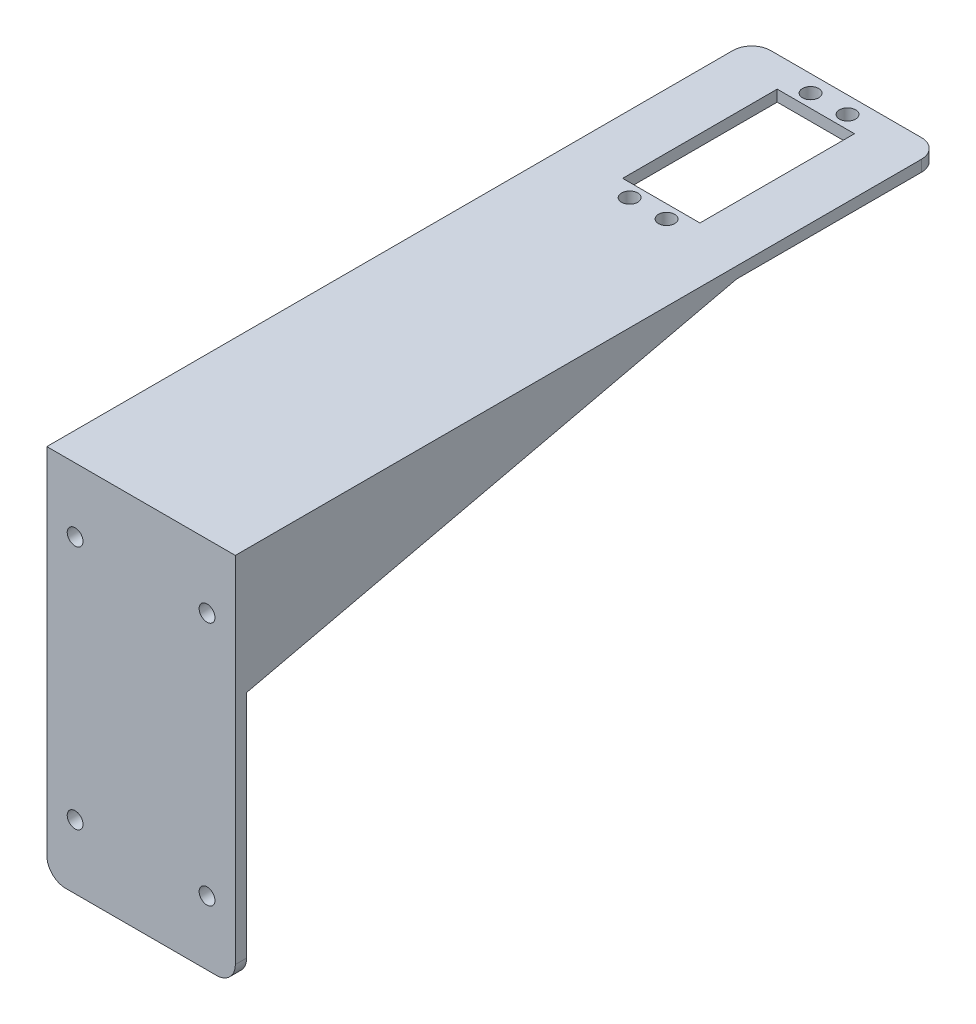
ISO-10303-21;
HEADER;
FILE_DESCRIPTION(('STEP AP214'),'2;1');
FILE_NAME('part.step','',(''),(''),'','','');
FILE_SCHEMA(('AUTOMOTIVE_DESIGN { 1 0 10303 214 1 1 1 1 }'));
ENDSEC;
DATA;
#1=APPLICATION_CONTEXT('core data for automotive mechanical design processes');
#2=APPLICATION_PROTOCOL_DEFINITION('international standard','automotive_design',2000,#1);
#3=PRODUCT_CONTEXT('',#1,'mechanical');
#4=PRODUCT('Part','Part','',(#3));
#5=PRODUCT_RELATED_PRODUCT_CATEGORY('part','',(#4));
#6=PRODUCT_DEFINITION_FORMATION('','',#4);
#7=PRODUCT_DEFINITION_CONTEXT('part definition',#1,'design');
#8=PRODUCT_DEFINITION('design','',#6,#7);
#9=PRODUCT_DEFINITION_SHAPE('','',#8);
#10=(LENGTH_UNIT() NAMED_UNIT(*) SI_UNIT(.MILLI.,.METRE.));
#11=(NAMED_UNIT(*) PLANE_ANGLE_UNIT() SI_UNIT($,.RADIAN.));
#12=(NAMED_UNIT(*) SI_UNIT($,.STERADIAN.) SOLID_ANGLE_UNIT());
#13=UNCERTAINTY_MEASURE_WITH_UNIT(LENGTH_MEASURE(1.E-05),#10,'distance_accuracy_value','');
#14=(GEOMETRIC_REPRESENTATION_CONTEXT(3) GLOBAL_UNCERTAINTY_ASSIGNED_CONTEXT((#13)) GLOBAL_UNIT_ASSIGNED_CONTEXT((#10,
#11,#12)) REPRESENTATION_CONTEXT('',''));
#15=CARTESIAN_POINT('',(0.,0.,0.));
#16=DIRECTION('',(0.,0.,1.));
#17=DIRECTION('',(1.,0.,0.));
#18=AXIS2_PLACEMENT_3D('',#15,#16,#17);
#19=CARTESIAN_POINT('',(0.,0.,0.));
#20=DIRECTION('',(0.,1.,0.));
#21=DIRECTION('',(0.,0.,1.));
#22=AXIS2_PLACEMENT_3D('',#19,#20,#21);
#23=PLANE('',#22);
#24=DIRECTION('',(-1.,0.,0.));
#25=VECTOR('',#24,1.);
#26=CARTESIAN_POINT('',(-10.25,0.,-44.5));
#27=LINE('',#26,#25);
#28=CARTESIAN_POINT('',(10.25,0.,-44.5));
#29=VERTEX_POINT('',#28);
#30=CARTESIAN_POINT('',(-10.25,0.,-44.5));
#31=VERTEX_POINT('',#30);
#32=EDGE_CURVE('E287',#29,#31,#27,.T.);
#33=ORIENTED_EDGE('',*,*,#32,.F.);
#34=DIRECTION('',(0.,0.,1.));
#35=VECTOR('',#34,1.);
#36=CARTESIAN_POINT('',(10.25,0.,-44.5));
#37=LINE('',#36,#35);
#38=CARTESIAN_POINT('',(10.25,0.,-85.5));
#39=VERTEX_POINT('',#38);
#40=EDGE_CURVE('E239',#39,#29,#37,.T.);
#41=ORIENTED_EDGE('',*,*,#40,.F.);
#42=DIRECTION('',(1.,0.,0.));
#43=VECTOR('',#42,1.);
#44=CARTESIAN_POINT('',(-10.25,0.,-85.5));
#45=LINE('',#44,#43);
#46=CARTESIAN_POINT('',(-10.25,0.,-85.5));
#47=VERTEX_POINT('',#46);
#48=EDGE_CURVE('E272',#47,#39,#45,.T.);
#49=ORIENTED_EDGE('',*,*,#48,.F.);
#50=DIRECTION('',(0.,0.,-1.));
#51=VECTOR('',#50,1.);
#52=CARTESIAN_POINT('',(-10.25,0.,-44.5));
#53=LINE('',#52,#51);
#54=EDGE_CURVE('E291',#31,#47,#53,.T.);
#55=ORIENTED_EDGE('',*,*,#54,.F.);
#56=EDGE_LOOP('',(#33,#41,#49,#55));
#57=FACE_BOUND('',#56,.T.);
#58=CARTESIAN_POINT('',(-4.89999999999996,0.,-89.));
#59=DIRECTION('',(0.,-1.,0.));
#60=DIRECTION('',(0.,0.,-1.));
#61=AXIS2_PLACEMENT_3D('',#58,#59,#60);
#62=CIRCLE('',#61,2.15);
#63=CARTESIAN_POINT('',(-4.89999999999996,0.,-91.15));
#64=VERTEX_POINT('',#63);
#65=EDGE_CURVE('E240',#64,#64,#62,.T.);
#66=ORIENTED_EDGE('',*,*,#65,.F.);
#67=EDGE_LOOP('',(#66));
#68=FACE_BOUND('',#67,.T.);
#69=CARTESIAN_POINT('',(4.90000000000004,0.,-89.));
#70=DIRECTION('',(0.,-1.,0.));
#71=DIRECTION('',(0.,0.,1.));
#72=AXIS2_PLACEMENT_3D('',#69,#70,#71);
#73=CIRCLE('',#72,2.15);
#74=CARTESIAN_POINT('',(4.90000000000004,0.,-86.85));
#75=VERTEX_POINT('',#74);
#76=EDGE_CURVE('E248',#75,#75,#73,.T.);
#77=ORIENTED_EDGE('',*,*,#76,.F.);
#78=EDGE_LOOP('',(#77));
#79=FACE_BOUND('',#78,.T.);
#80=CARTESIAN_POINT('',(4.89999999999996,0.,-41.));
#81=DIRECTION('',(0.,-1.,0.));
#82=DIRECTION('',(0.,0.,-1.));
#83=AXIS2_PLACEMENT_3D('',#80,#81,#82);
#84=CIRCLE('',#83,2.15);
#85=CARTESIAN_POINT('',(4.89999999999996,0.,-43.15));
#86=VERTEX_POINT('',#85);
#87=EDGE_CURVE('E256',#86,#86,#84,.T.);
#88=ORIENTED_EDGE('',*,*,#87,.F.);
#89=EDGE_LOOP('',(#88));
#90=FACE_BOUND('',#89,.T.);
#91=CARTESIAN_POINT('',(-4.90000000000004,0.,-41.));
#92=DIRECTION('',(0.,-1.,0.));
#93=DIRECTION('',(0.,0.,1.));
#94=AXIS2_PLACEMENT_3D('',#91,#92,#93);
#95=CIRCLE('',#94,2.15);
#96=CARTESIAN_POINT('',(-4.90000000000004,0.,-38.85));
#97=VERTEX_POINT('',#96);
#98=EDGE_CURVE('E234',#97,#97,#95,.T.);
#99=ORIENTED_EDGE('',*,*,#98,.F.);
#100=EDGE_LOOP('',(#99));
#101=FACE_BOUND('',#100,.T.);
#102=DIRECTION('',(0.,0.,-1.));
#103=VECTOR('',#102,1.);
#104=CARTESIAN_POINT('',(-23.,0.,90.5));
#105=LINE('',#104,#103);
#106=CARTESIAN_POINT('',(-23.,0.,90.5));
#107=VERTEX_POINT('',#106);
#108=CARTESIAN_POINT('',(-23.,0.,-39.5));
#109=VERTEX_POINT('',#108);
#110=EDGE_CURVE('E55',#107,#109,#105,.T.);
#111=ORIENTED_EDGE('',*,*,#110,.T.);
#112=DIRECTION('',(-1.,0.,0.));
#113=VECTOR('',#112,1.);
#114=CARTESIAN_POINT('',(-23.,0.,-39.5));
#115=LINE('',#114,#113);
#116=CARTESIAN_POINT('',(-25.,0.,-39.5));
#117=VERTEX_POINT('',#116);
#118=EDGE_CURVE('E59',#109,#117,#115,.T.);
#119=ORIENTED_EDGE('',*,*,#118,.T.);
#120=DIRECTION('',(0.,0.,1.));
#121=VECTOR('',#120,1.);
#122=CARTESIAN_POINT('',(-25.,0.,-93.5));
#123=LINE('',#122,#121);
#124=CARTESIAN_POINT('',(-25.,0.,-88.5));
#125=VERTEX_POINT('',#124);
#126=EDGE_CURVE('E316',#125,#117,#123,.T.);
#127=ORIENTED_EDGE('',*,*,#126,.F.);
#128=CARTESIAN_POINT('',(-20.,0.,-88.5));
#129=DIRECTION('',(0.,1.,0.));
#130=DIRECTION('',(0.,0.,1.));
#131=AXIS2_PLACEMENT_3D('',#128,#129,#130);
#132=CIRCLE('',#131,5.);
#133=CARTESIAN_POINT('',(-20.,0.,-93.5));
#134=VERTEX_POINT('',#133);
#135=EDGE_CURVE('E396',#125,#134,#132,.F.);
#136=ORIENTED_EDGE('',*,*,#135,.T.);
#137=DIRECTION('',(-1.,0.,0.));
#138=VECTOR('',#137,1.);
#139=CARTESIAN_POINT('',(-25.,0.,-93.5));
#140=LINE('',#139,#138);
#141=CARTESIAN_POINT('',(20.,0.,-93.5));
#142=VERTEX_POINT('',#141);
#143=EDGE_CURVE('E329',#142,#134,#140,.T.);
#144=ORIENTED_EDGE('',*,*,#143,.F.);
#145=CARTESIAN_POINT('',(20.,0.,-88.5));
#146=DIRECTION('',(0.,1.,0.));
#147=DIRECTION('',(0.,0.,1.));
#148=AXIS2_PLACEMENT_3D('',#145,#146,#147);
#149=CIRCLE('',#148,5.);
#150=CARTESIAN_POINT('',(25.,0.,-88.5));
#151=VERTEX_POINT('',#150);
#152=EDGE_CURVE('E399',#142,#151,#149,.F.);
#153=ORIENTED_EDGE('',*,*,#152,.T.);
#154=DIRECTION('',(0.,0.,-1.));
#155=VECTOR('',#154,1.);
#156=CARTESIAN_POINT('',(25.,0.,-93.5));
#157=LINE('',#156,#155);
#158=CARTESIAN_POINT('',(25.,0.,-39.5));
#159=VERTEX_POINT('',#158);
#160=EDGE_CURVE('E301',#159,#151,#157,.T.);
#161=ORIENTED_EDGE('',*,*,#160,.F.);
#162=DIRECTION('',(1.,0.,0.));
#163=VECTOR('',#162,1.);
#164=CARTESIAN_POINT('',(23.,0.,-39.5));
#165=LINE('',#164,#163);
#166=CARTESIAN_POINT('',(23.,0.,-39.5));
#167=VERTEX_POINT('',#166);
#168=EDGE_CURVE('E185',#167,#159,#165,.T.);
#169=ORIENTED_EDGE('',*,*,#168,.F.);
#170=DIRECTION('',(0.,0.,1.));
#171=VECTOR('',#170,1.);
#172=CARTESIAN_POINT('',(23.,0.,90.5));
#173=LINE('',#172,#171);
#174=CARTESIAN_POINT('',(23.,0.,90.5));
#175=VERTEX_POINT('',#174);
#176=EDGE_CURVE('E178',#167,#175,#173,.T.);
#177=ORIENTED_EDGE('',*,*,#176,.T.);
#178=DIRECTION('',(1.,0.,0.));
#179=VECTOR('',#178,1.);
#180=CARTESIAN_POINT('',(-25.,0.,90.5));
#181=LINE('',#180,#179);
#182=EDGE_CURVE('E163',#107,#175,#181,.T.);
#183=ORIENTED_EDGE('',*,*,#182,.F.);
#184=EDGE_LOOP('',(#111,#119,#127,#136,#144,#153,#161,#169,#177,#183));
#185=FACE_BOUND('',#184,.T.);
#186=ADVANCED_FACE('F39',(#57,#68,#79,#90,#101,#185),#23,.F.);
#187=CARTESIAN_POINT('',(25.,3.,-93.5));
#188=DIRECTION('',(-1.,0.,0.));
#189=DIRECTION('',(0.,0.,1.));
#190=AXIS2_PLACEMENT_3D('',#187,#188,#189);
#191=PLANE('',#190);
#192=DIRECTION('',(0.,0.224859506698758,-0.97439119569462));
#193=VECTOR('',#192,1.);
#194=CARTESIAN_POINT('',(25.,0.,-39.5));
#195=LINE('',#194,#193);
#196=CARTESIAN_POINT('',(25.,-30.,90.5));
#197=VERTEX_POINT('',#196);
#198=EDGE_CURVE('E187',#197,#159,#195,.T.);
#199=ORIENTED_EDGE('',*,*,#198,.T.);
#200=ORIENTED_EDGE('',*,*,#160,.T.);
#201=DIRECTION('',(0.,-1.,0.));
#202=VECTOR('',#201,1.);
#203=CARTESIAN_POINT('',(25.,3.,-88.5));
#204=LINE('',#203,#202);
#205=CARTESIAN_POINT('',(25.,3.,-88.5));
#206=VERTEX_POINT('',#205);
#207=EDGE_CURVE('E383',#151,#206,#204,.F.);
#208=ORIENTED_EDGE('',*,*,#207,.T.);
#209=DIRECTION('',(0.,0.,-1.));
#210=VECTOR('',#209,1.);
#211=CARTESIAN_POINT('',(25.,3.,-93.5));
#212=LINE('',#211,#210);
#213=CARTESIAN_POINT('',(25.,3.,93.5));
#214=VERTEX_POINT('',#213);
#215=EDGE_CURVE('E311',#214,#206,#212,.T.);
#216=ORIENTED_EDGE('',*,*,#215,.F.);
#217=DIRECTION('',(0.,-1.,0.));
#218=VECTOR('',#217,1.);
#219=CARTESIAN_POINT('',(25.,3.,93.5));
#220=LINE('',#219,#218);
#221=CARTESIAN_POINT('',(25.,-91.,93.5));
#222=VERTEX_POINT('',#221);
#223=EDGE_CURVE('E326',#214,#222,#220,.T.);
#224=ORIENTED_EDGE('',*,*,#223,.T.);
#225=DIRECTION('',(0.,0.,1.));
#226=VECTOR('',#225,1.);
#227=CARTESIAN_POINT('',(25.,-91.,90.5));
#228=LINE('',#227,#226);
#229=CARTESIAN_POINT('',(25.,-91.,90.5));
#230=VERTEX_POINT('',#229);
#231=EDGE_CURVE('E386',#222,#230,#228,.F.);
#232=ORIENTED_EDGE('',*,*,#231,.T.);
#233=DIRECTION('',(0.,1.,0.));
#234=VECTOR('',#233,1.);
#235=CARTESIAN_POINT('',(25.,-96.,90.5));
#236=LINE('',#235,#234);
#237=EDGE_CURVE('E226',#230,#197,#236,.T.);
#238=ORIENTED_EDGE('',*,*,#237,.T.);
#239=EDGE_LOOP('',(#199,#200,#208,#216,#224,#232,#238));
#240=FACE_BOUND('',#239,.T.);
#241=ADVANCED_FACE('F424',(#240),#191,.F.);
#242=CARTESIAN_POINT('',(-25.,3.,-93.5));
#243=DIRECTION('',(0.,0.,1.));
#244=DIRECTION('',(1.,0.,0.));
#245=AXIS2_PLACEMENT_3D('',#242,#243,#244);
#246=PLANE('',#245);
#247=DIRECTION('',(-1.,0.,0.));
#248=VECTOR('',#247,1.);
#249=CARTESIAN_POINT('',(-25.,3.,-93.5));
#250=LINE('',#249,#248);
#251=CARTESIAN_POINT('',(20.,3.,-93.5));
#252=VERTEX_POINT('',#251);
#253=CARTESIAN_POINT('',(-20.,3.,-93.5));
#254=VERTEX_POINT('',#253);
#255=EDGE_CURVE('E315',#252,#254,#250,.T.);
#256=ORIENTED_EDGE('',*,*,#255,.F.);
#257=DIRECTION('',(0.,-1.,0.));
#258=VECTOR('',#257,1.);
#259=CARTESIAN_POINT('',(20.,3.,-93.5));
#260=LINE('',#259,#258);
#261=EDGE_CURVE('E392',#252,#142,#260,.T.);
#262=ORIENTED_EDGE('',*,*,#261,.T.);
#263=ORIENTED_EDGE('',*,*,#143,.T.);
#264=DIRECTION('',(0.,-1.,0.));
#265=VECTOR('',#264,1.);
#266=CARTESIAN_POINT('',(-20.,3.,-93.5));
#267=LINE('',#266,#265);
#268=EDGE_CURVE('E389',#134,#254,#267,.F.);
#269=ORIENTED_EDGE('',*,*,#268,.T.);
#270=EDGE_LOOP('',(#256,#262,#263,#269));
#271=FACE_BOUND('',#270,.T.);
#272=ADVANCED_FACE('F417',(#271),#246,.F.);
#273=CARTESIAN_POINT('',(-25.,3.,-93.5));
#274=DIRECTION('',(1.,0.,0.));
#275=DIRECTION('',(0.,0.,-1.));
#276=AXIS2_PLACEMENT_3D('',#273,#274,#275);
#277=PLANE('',#276);
#278=ORIENTED_EDGE('',*,*,#126,.T.);
#279=DIRECTION('',(0.,-0.224859506698758,0.97439119569462));
#280=VECTOR('',#279,1.);
#281=CARTESIAN_POINT('',(-25.,0.,-39.5));
#282=LINE('',#281,#280);
#283=CARTESIAN_POINT('',(-25.,-30.,90.5));
#284=VERTEX_POINT('',#283);
#285=EDGE_CURVE('E450',#117,#284,#282,.T.);
#286=ORIENTED_EDGE('',*,*,#285,.T.);
#287=DIRECTION('',(0.,1.,0.));
#288=VECTOR('',#287,1.);
#289=CARTESIAN_POINT('',(-25.,-96.,90.5));
#290=LINE('',#289,#288);
#291=CARTESIAN_POINT('',(-25.,-91.,90.5));
#292=VERTEX_POINT('',#291);
#293=EDGE_CURVE('E231',#292,#284,#290,.T.);
#294=ORIENTED_EDGE('',*,*,#293,.F.);
#295=DIRECTION('',(0.,0.,-1.));
#296=VECTOR('',#295,1.);
#297=CARTESIAN_POINT('',(-25.,-91.,93.5));
#298=LINE('',#297,#296);
#299=CARTESIAN_POINT('',(-25.,-91.,93.5));
#300=VERTEX_POINT('',#299);
#301=EDGE_CURVE('E374',#292,#300,#298,.F.);
#302=ORIENTED_EDGE('',*,*,#301,.T.);
#303=DIRECTION('',(0.,-1.,0.));
#304=VECTOR('',#303,1.);
#305=CARTESIAN_POINT('',(-25.,3.,93.5));
#306=LINE('',#305,#304);
#307=CARTESIAN_POINT('',(-25.,3.,93.5));
#308=VERTEX_POINT('',#307);
#309=EDGE_CURVE('E338',#308,#300,#306,.T.);
#310=ORIENTED_EDGE('',*,*,#309,.F.);
#311=DIRECTION('',(0.,0.,1.));
#312=VECTOR('',#311,1.);
#313=CARTESIAN_POINT('',(-25.,3.,-93.5));
#314=LINE('',#313,#312);
#315=CARTESIAN_POINT('',(-25.,3.,-88.5));
#316=VERTEX_POINT('',#315);
#317=EDGE_CURVE('E320',#316,#308,#314,.T.);
#318=ORIENTED_EDGE('',*,*,#317,.F.);
#319=DIRECTION('',(0.,-1.,0.));
#320=VECTOR('',#319,1.);
#321=CARTESIAN_POINT('',(-25.,3.,-88.5));
#322=LINE('',#321,#320);
#323=EDGE_CURVE('E370',#316,#125,#322,.T.);
#324=ORIENTED_EDGE('',*,*,#323,.T.);
#325=EDGE_LOOP('',(#278,#286,#294,#302,#310,#318,#324));
#326=FACE_BOUND('',#325,.T.);
#327=ADVANCED_FACE('F413',(#326),#277,.F.);
#328=CARTESIAN_POINT('',(-25.,3.,93.5));
#329=DIRECTION('',(0.,0.,-1.));
#330=DIRECTION('',(-1.,0.,0.));
#331=AXIS2_PLACEMENT_3D('',#328,#329,#330);
#332=PLANE('',#331);
#333=CARTESIAN_POINT('',(-17.5,-79.,93.5));
#334=DIRECTION('',(0.,0.,1.));
#335=DIRECTION('',(-1.,0.,0.));
#336=AXIS2_PLACEMENT_3D('',#333,#334,#335);
#337=CIRCLE('',#336,2.1);
#338=CARTESIAN_POINT('',(-19.6,-79.,93.5));
#339=VERTEX_POINT('',#338);
#340=EDGE_CURVE('E201',#339,#339,#337,.T.);
#341=ORIENTED_EDGE('',*,*,#340,.F.);
#342=EDGE_LOOP('',(#341));
#343=FACE_BOUND('',#342,.T.);
#344=CARTESIAN_POINT('',(17.5,-79.,93.5));
#345=DIRECTION('',(0.,0.,1.));
#346=DIRECTION('',(1.,0.,0.));
#347=AXIS2_PLACEMENT_3D('',#344,#345,#346);
#348=CIRCLE('',#347,2.1);
#349=CARTESIAN_POINT('',(19.6,-79.,93.5));
#350=VERTEX_POINT('',#349);
#351=EDGE_CURVE('E209',#350,#350,#348,.T.);
#352=ORIENTED_EDGE('',*,*,#351,.F.);
#353=EDGE_LOOP('',(#352));
#354=FACE_BOUND('',#353,.T.);
#355=CARTESIAN_POINT('',(17.5,-14.,93.5));
#356=DIRECTION('',(0.,0.,1.));
#357=DIRECTION('',(-1.,0.,0.));
#358=AXIS2_PLACEMENT_3D('',#355,#356,#357);
#359=CIRCLE('',#358,2.1);
#360=CARTESIAN_POINT('',(15.4,-14.,93.5));
#361=VERTEX_POINT('',#360);
#362=EDGE_CURVE('E204',#361,#361,#359,.T.);
#363=ORIENTED_EDGE('',*,*,#362,.F.);
#364=EDGE_LOOP('',(#363));
#365=FACE_BOUND('',#364,.T.);
#366=CARTESIAN_POINT('',(-17.5,-14.,93.5));
#367=DIRECTION('',(0.,0.,1.));
#368=DIRECTION('',(1.,0.,0.));
#369=AXIS2_PLACEMENT_3D('',#366,#367,#368);
#370=CIRCLE('',#369,2.1);
#371=CARTESIAN_POINT('',(-15.4,-14.,93.5));
#372=VERTEX_POINT('',#371);
#373=EDGE_CURVE('E208',#372,#372,#370,.T.);
#374=ORIENTED_EDGE('',*,*,#373,.F.);
#375=EDGE_LOOP('',(#374));
#376=FACE_BOUND('',#375,.T.);
#377=ORIENTED_EDGE('',*,*,#309,.T.);
#378=CARTESIAN_POINT('',(-20.,-91.,93.5));
#379=DIRECTION('',(0.,0.,-1.));
#380=DIRECTION('',(-1.,0.,0.));
#381=AXIS2_PLACEMENT_3D('',#378,#379,#380);
#382=CIRCLE('',#381,5.);
#383=CARTESIAN_POINT('',(-20.,-96.,93.5));
#384=VERTEX_POINT('',#383);
#385=EDGE_CURVE('E380',#300,#384,#382,.F.);
#386=ORIENTED_EDGE('',*,*,#385,.T.);
#387=DIRECTION('',(-1.,0.,0.));
#388=VECTOR('',#387,1.);
#389=CARTESIAN_POINT('',(-25.,-96.,93.5));
#390=LINE('',#389,#388);
#391=CARTESIAN_POINT('',(20.,-96.,93.5));
#392=VERTEX_POINT('',#391);
#393=EDGE_CURVE('E223',#392,#384,#390,.T.);
#394=ORIENTED_EDGE('',*,*,#393,.F.);
#395=CARTESIAN_POINT('',(20.,-91.,93.5));
#396=DIRECTION('',(0.,0.,-1.));
#397=DIRECTION('',(-1.,0.,0.));
#398=AXIS2_PLACEMENT_3D('',#395,#396,#397);
#399=CIRCLE('',#398,5.);
#400=EDGE_CURVE('E377',#392,#222,#399,.F.);
#401=ORIENTED_EDGE('',*,*,#400,.T.);
#402=ORIENTED_EDGE('',*,*,#223,.F.);
#403=DIRECTION('',(1.,0.,0.));
#404=VECTOR('',#403,1.);
#405=CARTESIAN_POINT('',(-25.,3.,93.5));
#406=LINE('',#405,#404);
#407=EDGE_CURVE('E323',#308,#214,#406,.T.);
#408=ORIENTED_EDGE('',*,*,#407,.F.);
#409=EDGE_LOOP('',(#377,#386,#394,#401,#402,#408));
#410=FACE_BOUND('',#409,.T.);
#411=ADVANCED_FACE('F440',(#343,#354,#365,#376,#410),#332,.F.);
#412=CARTESIAN_POINT('',(0.,3.,0.));
#413=DIRECTION('',(0.,1.,0.));
#414=DIRECTION('',(0.,0.,1.));
#415=AXIS2_PLACEMENT_3D('',#412,#413,#414);
#416=PLANE('',#415);
#417=CARTESIAN_POINT('',(-4.90000000000004,3.,-41.));
#418=DIRECTION('',(0.,-1.,0.));
#419=DIRECTION('',(0.,0.,1.));
#420=AXIS2_PLACEMENT_3D('',#417,#418,#419);
#421=CIRCLE('',#420,2.15);
#422=CARTESIAN_POINT('',(-4.90000000000004,3.,-38.85));
#423=VERTEX_POINT('',#422);
#424=EDGE_CURVE('E260',#423,#423,#421,.T.);
#425=ORIENTED_EDGE('',*,*,#424,.T.);
#426=EDGE_LOOP('',(#425));
#427=FACE_BOUND('',#426,.T.);
#428=CARTESIAN_POINT('',(4.89999999999996,3.,-41.));
#429=DIRECTION('',(0.,-1.,0.));
#430=DIRECTION('',(0.,0.,-1.));
#431=AXIS2_PLACEMENT_3D('',#428,#429,#430);
#432=CIRCLE('',#431,2.15);
#433=CARTESIAN_POINT('',(4.89999999999996,3.,-43.15));
#434=VERTEX_POINT('',#433);
#435=EDGE_CURVE('E252',#434,#434,#432,.T.);
#436=ORIENTED_EDGE('',*,*,#435,.T.);
#437=EDGE_LOOP('',(#436));
#438=FACE_BOUND('',#437,.T.);
#439=CARTESIAN_POINT('',(4.90000000000004,3.,-89.));
#440=DIRECTION('',(0.,-1.,0.));
#441=DIRECTION('',(0.,0.,1.));
#442=AXIS2_PLACEMENT_3D('',#439,#440,#441);
#443=CIRCLE('',#442,2.15);
#444=CARTESIAN_POINT('',(4.90000000000004,3.,-86.85));
#445=VERTEX_POINT('',#444);
#446=EDGE_CURVE('E244',#445,#445,#443,.T.);
#447=ORIENTED_EDGE('',*,*,#446,.T.);
#448=EDGE_LOOP('',(#447));
#449=FACE_BOUND('',#448,.T.);
#450=CARTESIAN_POINT('',(-4.89999999999996,3.,-89.));
#451=DIRECTION('',(0.,-1.,0.));
#452=DIRECTION('',(0.,0.,-1.));
#453=AXIS2_PLACEMENT_3D('',#450,#451,#452);
#454=CIRCLE('',#453,2.15);
#455=CARTESIAN_POINT('',(-4.89999999999996,3.,-91.15));
#456=VERTEX_POINT('',#455);
#457=EDGE_CURVE('E235',#456,#456,#454,.T.);
#458=ORIENTED_EDGE('',*,*,#457,.T.);
#459=EDGE_LOOP('',(#458));
#460=FACE_BOUND('',#459,.T.);
#461=DIRECTION('',(0.,0.,1.));
#462=VECTOR('',#461,1.);
#463=CARTESIAN_POINT('',(10.25,3.,-44.5));
#464=LINE('',#463,#462);
#465=CARTESIAN_POINT('',(10.25,3.,-85.5));
#466=VERTEX_POINT('',#465);
#467=CARTESIAN_POINT('',(10.25,3.,-44.5));
#468=VERTEX_POINT('',#467);
#469=EDGE_CURVE('E267',#466,#468,#464,.T.);
#470=ORIENTED_EDGE('',*,*,#469,.T.);
#471=DIRECTION('',(-1.,0.,0.));
#472=VECTOR('',#471,1.);
#473=CARTESIAN_POINT('',(-10.25,3.,-44.5));
#474=LINE('',#473,#472);
#475=CARTESIAN_POINT('',(-10.25,3.,-44.5));
#476=VERTEX_POINT('',#475);
#477=EDGE_CURVE('E271',#468,#476,#474,.T.);
#478=ORIENTED_EDGE('',*,*,#477,.T.);
#479=DIRECTION('',(0.,0.,-1.));
#480=VECTOR('',#479,1.);
#481=CARTESIAN_POINT('',(-10.25,3.,-44.5));
#482=LINE('',#481,#480);
#483=CARTESIAN_POINT('',(-10.25,3.,-85.5));
#484=VERTEX_POINT('',#483);
#485=EDGE_CURVE('E276',#476,#484,#482,.T.);
#486=ORIENTED_EDGE('',*,*,#485,.T.);
#487=DIRECTION('',(1.,0.,0.));
#488=VECTOR('',#487,1.);
#489=CARTESIAN_POINT('',(-10.25,3.,-85.5));
#490=LINE('',#489,#488);
#491=EDGE_CURVE('E280',#484,#466,#490,.T.);
#492=ORIENTED_EDGE('',*,*,#491,.T.);
#493=EDGE_LOOP('',(#470,#478,#486,#492));
#494=FACE_BOUND('',#493,.T.);
#495=ORIENTED_EDGE('',*,*,#215,.T.);
#496=CARTESIAN_POINT('',(20.,3.,-88.5));
#497=DIRECTION('',(0.,1.,0.));
#498=DIRECTION('',(0.,0.,1.));
#499=AXIS2_PLACEMENT_3D('',#496,#497,#498);
#500=CIRCLE('',#499,5.);
#501=EDGE_CURVE('E11',#206,#252,#500,.T.);
#502=ORIENTED_EDGE('',*,*,#501,.T.);
#503=ORIENTED_EDGE('',*,*,#255,.T.);
#504=CARTESIAN_POINT('',(-20.,3.,-88.5));
#505=DIRECTION('',(0.,1.,0.));
#506=DIRECTION('',(0.,0.,1.));
#507=AXIS2_PLACEMENT_3D('',#504,#505,#506);
#508=CIRCLE('',#507,5.);
#509=EDGE_CURVE('E48',#254,#316,#508,.T.);
#510=ORIENTED_EDGE('',*,*,#509,.T.);
#511=ORIENTED_EDGE('',*,*,#317,.T.);
#512=ORIENTED_EDGE('',*,*,#407,.T.);
#513=EDGE_LOOP('',(#495,#502,#503,#510,#511,#512));
#514=FACE_BOUND('',#513,.T.);
#515=ADVANCED_FACE('F406',(#427,#438,#449,#460,#494,#514),#416,.T.);
#516=CARTESIAN_POINT('',(10.25,3.,-44.5));
#517=DIRECTION('',(1.,0.,0.));
#518=DIRECTION('',(0.,0.,-1.));
#519=AXIS2_PLACEMENT_3D('',#516,#517,#518);
#520=PLANE('',#519);
#521=ORIENTED_EDGE('',*,*,#40,.T.);
#522=DIRECTION('',(0.,-1.,0.));
#523=VECTOR('',#522,1.);
#524=CARTESIAN_POINT('',(10.25,3.,-44.5));
#525=LINE('',#524,#523);
#526=EDGE_CURVE('E284',#468,#29,#525,.T.);
#527=ORIENTED_EDGE('',*,*,#526,.F.);
#528=ORIENTED_EDGE('',*,*,#469,.F.);
#529=DIRECTION('',(0.,-1.,0.));
#530=VECTOR('',#529,1.);
#531=CARTESIAN_POINT('',(10.25,3.,-85.5));
#532=LINE('',#531,#530);
#533=EDGE_CURVE('E298',#466,#39,#532,.T.);
#534=ORIENTED_EDGE('',*,*,#533,.T.);
#535=EDGE_LOOP('',(#521,#527,#528,#534));
#536=FACE_BOUND('',#535,.T.);
#537=ADVANCED_FACE('F551',(#536),#520,.F.);
#538=CARTESIAN_POINT('',(-10.25,3.,-85.5));
#539=DIRECTION('',(0.,0.,-1.));
#540=DIRECTION('',(-1.,0.,0.));
#541=AXIS2_PLACEMENT_3D('',#538,#539,#540);
#542=PLANE('',#541);
#543=ORIENTED_EDGE('',*,*,#48,.T.);
#544=ORIENTED_EDGE('',*,*,#533,.F.);
#545=ORIENTED_EDGE('',*,*,#491,.F.);
#546=DIRECTION('',(0.,-1.,0.));
#547=VECTOR('',#546,1.);
#548=CARTESIAN_POINT('',(-10.25,3.,-85.5));
#549=LINE('',#548,#547);
#550=EDGE_CURVE('E302',#484,#47,#549,.T.);
#551=ORIENTED_EDGE('',*,*,#550,.T.);
#552=EDGE_LOOP('',(#543,#544,#545,#551));
#553=FACE_BOUND('',#552,.T.);
#554=ADVANCED_FACE('F547',(#553),#542,.F.);
#555=CARTESIAN_POINT('',(-10.25,3.,-44.5));
#556=DIRECTION('',(-1.,0.,0.));
#557=DIRECTION('',(0.,0.,1.));
#558=AXIS2_PLACEMENT_3D('',#555,#556,#557);
#559=PLANE('',#558);
#560=ORIENTED_EDGE('',*,*,#54,.T.);
#561=ORIENTED_EDGE('',*,*,#550,.F.);
#562=ORIENTED_EDGE('',*,*,#485,.F.);
#563=DIRECTION('',(0.,-1.,0.));
#564=VECTOR('',#563,1.);
#565=CARTESIAN_POINT('',(-10.25,3.,-44.5));
#566=LINE('',#565,#564);
#567=EDGE_CURVE('E305',#476,#31,#566,.T.);
#568=ORIENTED_EDGE('',*,*,#567,.T.);
#569=EDGE_LOOP('',(#560,#561,#562,#568));
#570=FACE_BOUND('',#569,.T.);
#571=ADVANCED_FACE('F550',(#570),#559,.F.);
#572=CARTESIAN_POINT('',(-10.25,3.,-44.5));
#573=DIRECTION('',(0.,0.,1.));
#574=DIRECTION('',(1.,0.,0.));
#575=AXIS2_PLACEMENT_3D('',#572,#573,#574);
#576=PLANE('',#575);
#577=ORIENTED_EDGE('',*,*,#32,.T.);
#578=ORIENTED_EDGE('',*,*,#567,.F.);
#579=ORIENTED_EDGE('',*,*,#477,.F.);
#580=ORIENTED_EDGE('',*,*,#526,.T.);
#581=EDGE_LOOP('',(#577,#578,#579,#580));
#582=FACE_BOUND('',#581,.T.);
#583=ADVANCED_FACE('F535',(#582),#576,.F.);
#584=CARTESIAN_POINT('',(-4.89999999999996,3.,-89.));
#585=DIRECTION('',(0.,-1.,0.));
#586=DIRECTION('',(0.,0.,-1.));
#587=AXIS2_PLACEMENT_3D('',#584,#585,#586);
#588=CYLINDRICAL_SURFACE('',#587,2.15);
#589=ORIENTED_EDGE('',*,*,#457,.F.);
#590=EDGE_LOOP('',(#589));
#591=FACE_BOUND('',#590,.T.);
#592=ORIENTED_EDGE('',*,*,#65,.T.);
#593=EDGE_LOOP('',(#592));
#594=FACE_BOUND('',#593,.T.);
#595=ADVANCED_FACE('F531',(#591,#594),#588,.F.);
#596=CARTESIAN_POINT('',(4.90000000000004,3.,-89.));
#597=DIRECTION('',(0.,-1.,0.));
#598=DIRECTION('',(0.,0.,-1.));
#599=AXIS2_PLACEMENT_3D('',#596,#597,#598);
#600=CYLINDRICAL_SURFACE('',#599,2.15);
#601=ORIENTED_EDGE('',*,*,#446,.F.);
#602=EDGE_LOOP('',(#601));
#603=FACE_BOUND('',#602,.T.);
#604=ORIENTED_EDGE('',*,*,#76,.T.);
#605=EDGE_LOOP('',(#604));
#606=FACE_BOUND('',#605,.T.);
#607=ADVANCED_FACE('F534',(#603,#606),#600,.F.);
#608=CARTESIAN_POINT('',(4.89999999999996,3.,-41.));
#609=DIRECTION('',(0.,-1.,0.));
#610=DIRECTION('',(0.,0.,-1.));
#611=AXIS2_PLACEMENT_3D('',#608,#609,#610);
#612=CYLINDRICAL_SURFACE('',#611,2.15);
#613=ORIENTED_EDGE('',*,*,#435,.F.);
#614=EDGE_LOOP('',(#613));
#615=FACE_BOUND('',#614,.T.);
#616=ORIENTED_EDGE('',*,*,#87,.T.);
#617=EDGE_LOOP('',(#616));
#618=FACE_BOUND('',#617,.T.);
#619=ADVANCED_FACE('F539',(#615,#618),#612,.F.);
#620=CARTESIAN_POINT('',(-4.90000000000004,3.,-41.));
#621=DIRECTION('',(0.,-1.,0.));
#622=DIRECTION('',(0.,0.,-1.));
#623=AXIS2_PLACEMENT_3D('',#620,#621,#622);
#624=CYLINDRICAL_SURFACE('',#623,2.15);
#625=ORIENTED_EDGE('',*,*,#424,.F.);
#626=EDGE_LOOP('',(#625));
#627=FACE_BOUND('',#626,.T.);
#628=ORIENTED_EDGE('',*,*,#98,.T.);
#629=EDGE_LOOP('',(#628));
#630=FACE_BOUND('',#629,.T.);
#631=ADVANCED_FACE('F529',(#627,#630),#624,.F.);
#632=CARTESIAN_POINT('',(-25.,-96.,90.5));
#633=DIRECTION('',(0.,0.,1.));
#634=DIRECTION('',(1.,0.,0.));
#635=AXIS2_PLACEMENT_3D('',#632,#633,#634);
#636=PLANE('',#635);
#637=CARTESIAN_POINT('',(-17.5,-79.,90.5));
#638=DIRECTION('',(0.,0.,1.));
#639=DIRECTION('',(1.,0.,0.));
#640=AXIS2_PLACEMENT_3D('',#637,#638,#639);
#641=CIRCLE('',#640,2.1);
#642=CARTESIAN_POINT('',(-15.4,-79.,90.5));
#643=VERTEX_POINT('',#642);
#644=EDGE_CURVE('E173',#643,#643,#641,.T.);
#645=ORIENTED_EDGE('',*,*,#644,.T.);
#646=EDGE_LOOP('',(#645));
#647=FACE_BOUND('',#646,.T.);
#648=CARTESIAN_POINT('',(17.5,-79.,90.5));
#649=DIRECTION('',(0.,0.,1.));
#650=DIRECTION('',(1.,0.,0.));
#651=AXIS2_PLACEMENT_3D('',#648,#649,#650);
#652=CIRCLE('',#651,2.1);
#653=CARTESIAN_POINT('',(19.6,-79.,90.5));
#654=VERTEX_POINT('',#653);
#655=EDGE_CURVE('E350',#654,#654,#652,.T.);
#656=ORIENTED_EDGE('',*,*,#655,.T.);
#657=EDGE_LOOP('',(#656));
#658=FACE_BOUND('',#657,.T.);
#659=CARTESIAN_POINT('',(17.5,-14.,90.5));
#660=DIRECTION('',(0.,0.,1.));
#661=DIRECTION('',(1.,0.,0.));
#662=AXIS2_PLACEMENT_3D('',#659,#660,#661);
#663=CIRCLE('',#662,2.1);
#664=CARTESIAN_POINT('',(19.6,-14.,90.5));
#665=VERTEX_POINT('',#664);
#666=EDGE_CURVE('E346',#665,#665,#663,.T.);
#667=ORIENTED_EDGE('',*,*,#666,.T.);
#668=EDGE_LOOP('',(#667));
#669=FACE_BOUND('',#668,.T.);
#670=CARTESIAN_POINT('',(-17.5,-14.,90.5));
#671=DIRECTION('',(0.,0.,1.));
#672=DIRECTION('',(1.,0.,0.));
#673=AXIS2_PLACEMENT_3D('',#670,#671,#672);
#674=CIRCLE('',#673,2.1);
#675=CARTESIAN_POINT('',(-15.4,-14.,90.5));
#676=VERTEX_POINT('',#675);
#677=EDGE_CURVE('E219',#676,#676,#674,.T.);
#678=ORIENTED_EDGE('',*,*,#677,.T.);
#679=EDGE_LOOP('',(#678));
#680=FACE_BOUND('',#679,.T.);
#681=ORIENTED_EDGE('',*,*,#293,.T.);
#682=DIRECTION('',(-1.,0.,0.));
#683=VECTOR('',#682,1.);
#684=CARTESIAN_POINT('',(-23.,-30.,90.5));
#685=LINE('',#684,#683);
#686=CARTESIAN_POINT('',(-23.,-30.,90.5));
#687=VERTEX_POINT('',#686);
#688=EDGE_CURVE('E191',#687,#284,#685,.T.);
#689=ORIENTED_EDGE('',*,*,#688,.F.);
#690=DIRECTION('',(0.,1.,0.));
#691=VECTOR('',#690,1.);
#692=CARTESIAN_POINT('',(-23.,-30.,90.5));
#693=LINE('',#692,#691);
#694=EDGE_CURVE('E169',#687,#107,#693,.T.);
#695=ORIENTED_EDGE('',*,*,#694,.T.);
#696=ORIENTED_EDGE('',*,*,#182,.T.);
#697=DIRECTION('',(0.,-1.,0.));
#698=VECTOR('',#697,1.);
#699=CARTESIAN_POINT('',(23.,-30.,90.5));
#700=LINE('',#699,#698);
#701=CARTESIAN_POINT('',(23.,-30.,90.5));
#702=VERTEX_POINT('',#701);
#703=EDGE_CURVE('E167',#175,#702,#700,.T.);
#704=ORIENTED_EDGE('',*,*,#703,.T.);
#705=DIRECTION('',(1.,0.,0.));
#706=VECTOR('',#705,1.);
#707=CARTESIAN_POINT('',(23.,-30.,90.5));
#708=LINE('',#707,#706);
#709=EDGE_CURVE('E197',#702,#197,#708,.T.);
#710=ORIENTED_EDGE('',*,*,#709,.T.);
#711=ORIENTED_EDGE('',*,*,#237,.F.);
#712=CARTESIAN_POINT('',(20.,-91.,90.5));
#713=DIRECTION('',(0.,0.,1.));
#714=DIRECTION('',(1.,0.,0.));
#715=AXIS2_PLACEMENT_3D('',#712,#713,#714);
#716=CIRCLE('',#715,5.);
#717=CARTESIAN_POINT('',(20.,-96.,90.5));
#718=VERTEX_POINT('',#717);
#719=EDGE_CURVE('E364',#230,#718,#716,.F.);
#720=ORIENTED_EDGE('',*,*,#719,.T.);
#721=DIRECTION('',(1.,0.,0.));
#722=VECTOR('',#721,1.);
#723=CARTESIAN_POINT('',(-25.,-96.,90.5));
#724=LINE('',#723,#722);
#725=CARTESIAN_POINT('',(-20.,-96.,90.5));
#726=VERTEX_POINT('',#725);
#727=EDGE_CURVE('E172',#726,#718,#724,.T.);
#728=ORIENTED_EDGE('',*,*,#727,.F.);
#729=CARTESIAN_POINT('',(-20.,-91.,90.5));
#730=DIRECTION('',(0.,0.,1.));
#731=DIRECTION('',(1.,0.,0.));
#732=AXIS2_PLACEMENT_3D('',#729,#730,#731);
#733=CIRCLE('',#732,5.);
#734=EDGE_CURVE('E367',#726,#292,#733,.F.);
#735=ORIENTED_EDGE('',*,*,#734,.T.);
#736=EDGE_LOOP('',(#681,#689,#695,#696,#704,#710,#711,#720,#728,#735));
#737=FACE_BOUND('',#736,.T.);
#738=ADVANCED_FACE('F165',(#647,#658,#669,#680,#737),#636,.F.);
#739=CARTESIAN_POINT('',(0.,-96.,0.));
#740=DIRECTION('',(0.,-1.,0.));
#741=DIRECTION('',(0.,0.,-1.));
#742=AXIS2_PLACEMENT_3D('',#739,#740,#741);
#743=PLANE('',#742);
#744=ORIENTED_EDGE('',*,*,#393,.T.);
#745=DIRECTION('',(0.,0.,-1.));
#746=VECTOR('',#745,1.);
#747=CARTESIAN_POINT('',(-20.,-96.,90.5));
#748=LINE('',#747,#746);
#749=EDGE_CURVE('E360',#384,#726,#748,.T.);
#750=ORIENTED_EDGE('',*,*,#749,.T.);
#751=ORIENTED_EDGE('',*,*,#727,.T.);
#752=DIRECTION('',(0.,0.,1.));
#753=VECTOR('',#752,1.);
#754=CARTESIAN_POINT('',(20.,-96.,93.5));
#755=LINE('',#754,#753);
#756=EDGE_CURVE('E342',#718,#392,#755,.T.);
#757=ORIENTED_EDGE('',*,*,#756,.T.);
#758=EDGE_LOOP('',(#744,#750,#751,#757));
#759=FACE_BOUND('',#758,.T.);
#760=ADVANCED_FACE('F437',(#759),#743,.T.);
#761=CARTESIAN_POINT('',(-17.5,-14.,-93.5));
#762=DIRECTION('',(0.,0.,1.));
#763=DIRECTION('',(1.,0.,0.));
#764=AXIS2_PLACEMENT_3D('',#761,#762,#763);
#765=CYLINDRICAL_SURFACE('',#764,2.1);
#766=ORIENTED_EDGE('',*,*,#373,.T.);
#767=EDGE_LOOP('',(#766));
#768=FACE_BOUND('',#767,.T.);
#769=ORIENTED_EDGE('',*,*,#677,.F.);
#770=EDGE_LOOP('',(#769));
#771=FACE_BOUND('',#770,.T.);
#772=ADVANCED_FACE('F514',(#768,#771),#765,.F.);
#773=CARTESIAN_POINT('',(17.5,-14.,-93.5));
#774=DIRECTION('',(0.,0.,1.));
#775=DIRECTION('',(1.,0.,0.));
#776=AXIS2_PLACEMENT_3D('',#773,#774,#775);
#777=CYLINDRICAL_SURFACE('',#776,2.1);
#778=ORIENTED_EDGE('',*,*,#362,.T.);
#779=EDGE_LOOP('',(#778));
#780=FACE_BOUND('',#779,.T.);
#781=ORIENTED_EDGE('',*,*,#666,.F.);
#782=EDGE_LOOP('',(#781));
#783=FACE_BOUND('',#782,.T.);
#784=ADVANCED_FACE('F510',(#780,#783),#777,.F.);
#785=CARTESIAN_POINT('',(17.5,-79.,-93.5));
#786=DIRECTION('',(0.,0.,1.));
#787=DIRECTION('',(1.,0.,0.));
#788=AXIS2_PLACEMENT_3D('',#785,#786,#787);
#789=CYLINDRICAL_SURFACE('',#788,2.1);
#790=ORIENTED_EDGE('',*,*,#351,.T.);
#791=EDGE_LOOP('',(#790));
#792=FACE_BOUND('',#791,.T.);
#793=ORIENTED_EDGE('',*,*,#655,.F.);
#794=EDGE_LOOP('',(#793));
#795=FACE_BOUND('',#794,.T.);
#796=ADVANCED_FACE('F513',(#792,#795),#789,.F.);
#797=CARTESIAN_POINT('',(-17.5,-79.,-93.5));
#798=DIRECTION('',(0.,0.,1.));
#799=DIRECTION('',(1.,0.,0.));
#800=AXIS2_PLACEMENT_3D('',#797,#798,#799);
#801=CYLINDRICAL_SURFACE('',#800,2.1);
#802=ORIENTED_EDGE('',*,*,#340,.T.);
#803=EDGE_LOOP('',(#802));
#804=FACE_BOUND('',#803,.T.);
#805=ORIENTED_EDGE('',*,*,#644,.F.);
#806=EDGE_LOOP('',(#805));
#807=FACE_BOUND('',#806,.T.);
#808=ADVANCED_FACE('F495',(#804,#807),#801,.F.);
#809=CARTESIAN_POINT('',(-20.,-91.,0.));
#810=DIRECTION('',(0.,0.,1.));
#811=DIRECTION('',(1.,0.,0.));
#812=AXIS2_PLACEMENT_3D('',#809,#810,#811);
#813=CYLINDRICAL_SURFACE('',#812,5.);
#814=ORIENTED_EDGE('',*,*,#385,.F.);
#815=ORIENTED_EDGE('',*,*,#301,.F.);
#816=ORIENTED_EDGE('',*,*,#734,.F.);
#817=ORIENTED_EDGE('',*,*,#749,.F.);
#818=EDGE_LOOP('',(#814,#815,#816,#817));
#819=FACE_BOUND('',#818,.T.);
#820=ADVANCED_FACE('F445',(#819),#813,.T.);
#821=CARTESIAN_POINT('',(20.,-91.,0.));
#822=DIRECTION('',(0.,0.,-1.));
#823=DIRECTION('',(-1.,0.,0.));
#824=AXIS2_PLACEMENT_3D('',#821,#822,#823);
#825=CYLINDRICAL_SURFACE('',#824,5.);
#826=ORIENTED_EDGE('',*,*,#719,.F.);
#827=ORIENTED_EDGE('',*,*,#231,.F.);
#828=ORIENTED_EDGE('',*,*,#400,.F.);
#829=ORIENTED_EDGE('',*,*,#756,.F.);
#830=EDGE_LOOP('',(#826,#827,#828,#829));
#831=FACE_BOUND('',#830,.T.);
#832=ADVANCED_FACE('F434',(#831),#825,.T.);
#833=CARTESIAN_POINT('',(20.,3.,-88.5));
#834=DIRECTION('',(0.,-1.,0.));
#835=DIRECTION('',(0.,0.,-1.));
#836=AXIS2_PLACEMENT_3D('',#833,#834,#835);
#837=CYLINDRICAL_SURFACE('',#836,5.);
#838=ORIENTED_EDGE('',*,*,#501,.F.);
#839=ORIENTED_EDGE('',*,*,#207,.F.);
#840=ORIENTED_EDGE('',*,*,#152,.F.);
#841=ORIENTED_EDGE('',*,*,#261,.F.);
#842=EDGE_LOOP('',(#838,#839,#840,#841));
#843=FACE_BOUND('',#842,.T.);
#844=ADVANCED_FACE('F421',(#843),#837,.T.);
#845=CARTESIAN_POINT('',(-20.,3.,-88.5));
#846=DIRECTION('',(0.,-1.,0.));
#847=DIRECTION('',(0.,0.,-1.));
#848=AXIS2_PLACEMENT_3D('',#845,#846,#847);
#849=CYLINDRICAL_SURFACE('',#848,5.);
#850=ORIENTED_EDGE('',*,*,#509,.F.);
#851=ORIENTED_EDGE('',*,*,#268,.F.);
#852=ORIENTED_EDGE('',*,*,#135,.F.);
#853=ORIENTED_EDGE('',*,*,#323,.F.);
#854=EDGE_LOOP('',(#850,#851,#852,#853));
#855=FACE_BOUND('',#854,.T.);
#856=ADVANCED_FACE('F41',(#855),#849,.T.);
#857=CARTESIAN_POINT('',(23.,0.,-39.5));
#858=DIRECTION('',(0.,-0.97439119569462,-0.224859506698758));
#859=DIRECTION('',(0.,0.224859506698758,-0.97439119569462));
#860=AXIS2_PLACEMENT_3D('',#857,#858,#859);
#861=PLANE('',#860);
#862=ORIENTED_EDGE('',*,*,#198,.F.);
#863=ORIENTED_EDGE('',*,*,#709,.F.);
#864=DIRECTION('',(0.,0.224859506698758,-0.97439119569462));
#865=VECTOR('',#864,1.);
#866=CARTESIAN_POINT('',(23.,0.,-39.5));
#867=LINE('',#866,#865);
#868=EDGE_CURVE('E180',#702,#167,#867,.T.);
#869=ORIENTED_EDGE('',*,*,#868,.T.);
#870=ORIENTED_EDGE('',*,*,#168,.T.);
#871=EDGE_LOOP('',(#862,#863,#869,#870));
#872=FACE_BOUND('',#871,.T.);
#873=ADVANCED_FACE('F428',(#872),#861,.T.);
#874=CARTESIAN_POINT('',(23.,0.,0.));
#875=DIRECTION('',(1.,0.,0.));
#876=DIRECTION('',(0.,0.,-1.));
#877=AXIS2_PLACEMENT_3D('',#874,#875,#876);
#878=PLANE('',#877);
#879=ORIENTED_EDGE('',*,*,#176,.F.);
#880=ORIENTED_EDGE('',*,*,#868,.F.);
#881=ORIENTED_EDGE('',*,*,#703,.F.);
#882=EDGE_LOOP('',(#879,#880,#881));
#883=FACE_BOUND('',#882,.T.);
#884=ADVANCED_FACE('F177',(#883),#878,.F.);
#885=CARTESIAN_POINT('',(-23.,0.,-39.5));
#886=DIRECTION('',(0.,-0.97439119569462,-0.224859506698758));
#887=DIRECTION('',(0.,0.224859506698758,-0.97439119569462));
#888=AXIS2_PLACEMENT_3D('',#885,#886,#887);
#889=PLANE('',#888);
#890=ORIENTED_EDGE('',*,*,#285,.F.);
#891=ORIENTED_EDGE('',*,*,#118,.F.);
#892=DIRECTION('',(0.,-0.224859506698758,0.97439119569462));
#893=VECTOR('',#892,1.);
#894=CARTESIAN_POINT('',(-23.,0.,-39.5));
#895=LINE('',#894,#893);
#896=EDGE_CURVE('E455',#109,#687,#895,.T.);
#897=ORIENTED_EDGE('',*,*,#896,.T.);
#898=ORIENTED_EDGE('',*,*,#688,.T.);
#899=EDGE_LOOP('',(#890,#891,#897,#898));
#900=FACE_BOUND('',#899,.T.);
#901=ADVANCED_FACE('F465',(#900),#889,.T.);
#902=CARTESIAN_POINT('',(-23.,0.,0.));
#903=DIRECTION('',(1.,0.,0.));
#904=DIRECTION('',(0.,0.,-1.));
#905=AXIS2_PLACEMENT_3D('',#902,#903,#904);
#906=PLANE('',#905);
#907=ORIENTED_EDGE('',*,*,#110,.F.);
#908=ORIENTED_EDGE('',*,*,#694,.F.);
#909=ORIENTED_EDGE('',*,*,#896,.F.);
#910=EDGE_LOOP('',(#907,#908,#909));
#911=FACE_BOUND('',#910,.T.);
#912=ADVANCED_FACE('F467',(#911),#906,.T.);
#913=CLOSED_SHELL('',(#186,#241,#272,#327,#411,#515,#537,#554,#571,#583,#595,#607,#619,#631,
#738,#760,#772,#784,#796,#808,#820,#832,#844,#856,#873,#884,#901,#912));
#914=MANIFOLD_SOLID_BREP('B2',#913);
#915=ADVANCED_BREP_SHAPE_REPRESENTATION('',(#18,#914),#14);
#916=SHAPE_DEFINITION_REPRESENTATION(#9,#915);
ENDSEC;
END-ISO-10303-21;
